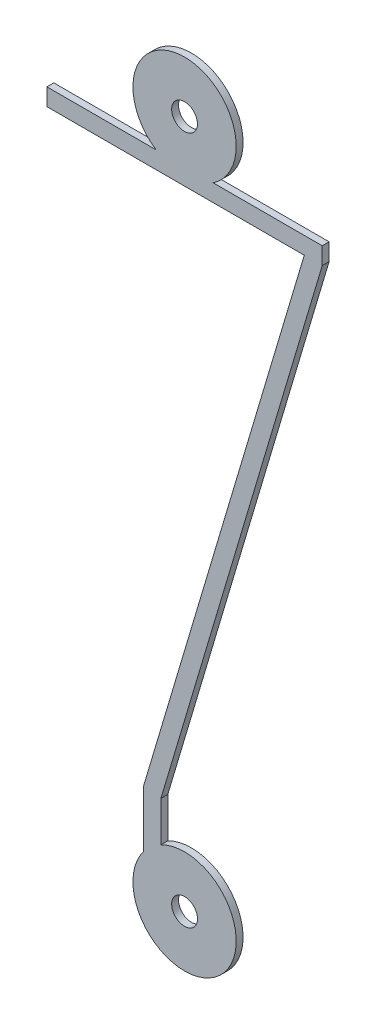
ISO-10303-21;
HEADER;
FILE_DESCRIPTION(('STEP AP214'),'2;1');
FILE_NAME('part.step','',(''),(''),'','','');
FILE_SCHEMA(('AUTOMOTIVE_DESIGN { 1 0 10303 214 1 1 1 1 }'));
ENDSEC;
DATA;
#1=APPLICATION_CONTEXT('core data for automotive mechanical design processes');
#2=APPLICATION_PROTOCOL_DEFINITION('international standard','automotive_design',2000,#1);
#3=PRODUCT_CONTEXT('',#1,'mechanical');
#4=PRODUCT('Part','Part','',(#3));
#5=PRODUCT_RELATED_PRODUCT_CATEGORY('part','',(#4));
#6=PRODUCT_DEFINITION_FORMATION('','',#4);
#7=PRODUCT_DEFINITION_CONTEXT('part definition',#1,'design');
#8=PRODUCT_DEFINITION('design','',#6,#7);
#9=PRODUCT_DEFINITION_SHAPE('','',#8);
#10=(LENGTH_UNIT() NAMED_UNIT(*) SI_UNIT(.MILLI.,.METRE.));
#11=(NAMED_UNIT(*) PLANE_ANGLE_UNIT() SI_UNIT($,.RADIAN.));
#12=(NAMED_UNIT(*) SI_UNIT($,.STERADIAN.) SOLID_ANGLE_UNIT());
#13=UNCERTAINTY_MEASURE_WITH_UNIT(LENGTH_MEASURE(1.E-05),#10,'distance_accuracy_value','');
#14=(GEOMETRIC_REPRESENTATION_CONTEXT(3) GLOBAL_UNCERTAINTY_ASSIGNED_CONTEXT((#13)) GLOBAL_UNIT_ASSIGNED_CONTEXT((#10,
#11,#12)) REPRESENTATION_CONTEXT('',''));
#15=CARTESIAN_POINT('',(0.,0.,0.));
#16=DIRECTION('',(0.,0.,1.));
#17=DIRECTION('',(1.,0.,0.));
#18=AXIS2_PLACEMENT_3D('',#15,#16,#17);
#19=CARTESIAN_POINT('',(0.,10.,0.1));
#20=DIRECTION('',(0.,0.,1.));
#21=DIRECTION('',(1.,0.,0.));
#22=AXIS2_PLACEMENT_3D('',#19,#20,#21);
#23=PLANE('',#22);
#24=CARTESIAN_POINT('',(0.,10.,0.1));
#25=DIRECTION('',(0.,0.,1.));
#26=DIRECTION('',(1.,0.,0.));
#27=AXIS2_PLACEMENT_3D('',#24,#25,#26);
#28=CIRCLE('',#27,0.375);
#29=CARTESIAN_POINT('',(0.375,10.,0.1));
#30=VERTEX_POINT('',#29);
#31=EDGE_CURVE('E153',#30,#30,#28,.T.);
#32=ORIENTED_EDGE('',*,*,#31,.F.);
#33=EDGE_LOOP('',(#32));
#34=FACE_BOUND('',#33,.T.);
#35=CARTESIAN_POINT('',(0.,10.,0.1));
#36=DIRECTION('',(0.,0.,1.));
#37=DIRECTION('',(1.,0.,0.));
#38=AXIS2_PLACEMENT_3D('',#35,#36,#37);
#39=CIRCLE('',#38,1.5);
#40=CARTESIAN_POINT('',(0.829156197588853,8.75,0.1));
#41=VERTEX_POINT('',#40);
#42=CARTESIAN_POINT('',(-0.829156197588853,8.75,0.1));
#43=VERTEX_POINT('',#42);
#44=EDGE_CURVE('E170',#41,#43,#39,.T.);
#45=ORIENTED_EDGE('',*,*,#44,.T.);
#46=DIRECTION('',(-1.,0.,0.));
#47=VECTOR('',#46,1.);
#48=CARTESIAN_POINT('',(-4.,8.75,0.1));
#49=LINE('',#48,#47);
#50=CARTESIAN_POINT('',(-4.,8.75,0.1));
#51=VERTEX_POINT('',#50);
#52=EDGE_CURVE('E103',#43,#51,#49,.T.);
#53=ORIENTED_EDGE('',*,*,#52,.T.);
#54=DIRECTION('',(0.,-1.,0.));
#55=VECTOR('',#54,1.);
#56=CARTESIAN_POINT('',(-4.,8.75,0.1));
#57=LINE('',#56,#55);
#58=CARTESIAN_POINT('',(-4.,8.25,0.1));
#59=VERTEX_POINT('',#58);
#60=EDGE_CURVE('E194',#51,#59,#57,.T.);
#61=ORIENTED_EDGE('',*,*,#60,.T.);
#62=DIRECTION('',(1.,0.,0.));
#63=VECTOR('',#62,1.);
#64=CARTESIAN_POINT('',(-4.,8.25,0.1));
#65=LINE('',#64,#63);
#66=CARTESIAN_POINT('',(3.47832550917606,8.25,0.1));
#67=VERTEX_POINT('',#66);
#68=EDGE_CURVE('E213',#59,#67,#65,.T.);
#69=ORIENTED_EDGE('',*,*,#68,.T.);
#70=DIRECTION('',(-0.285253594774189,-0.958452078441276,0.));
#71=VECTOR('',#70,1.);
#72=CARTESIAN_POINT('',(3.47832550917606,8.25,0.1));
#73=LINE('',#72,#71);
#74=CARTESIAN_POINT('',(-1.18749999999999,-7.42717371083153,0.1));
#75=VERTEX_POINT('',#74);
#76=EDGE_CURVE('E210',#67,#75,#73,.T.);
#77=ORIENTED_EDGE('',*,*,#76,.T.);
#78=DIRECTION('',(0.,-1.,0.));
#79=VECTOR('',#78,1.);
#80=CARTESIAN_POINT('',(-1.18749999999999,-9.08357010633655,0.1));
#81=LINE('',#80,#79);
#82=CARTESIAN_POINT('',(-1.18749999999999,-9.08357010633655,0.1));
#83=VERTEX_POINT('',#82);
#84=EDGE_CURVE('E212',#75,#83,#81,.T.);
#85=ORIENTED_EDGE('',*,*,#84,.T.);
#86=CARTESIAN_POINT('',(0.,-10.,0.1));
#87=DIRECTION('',(0.,0.,1.));
#88=DIRECTION('',(1.,0.,0.));
#89=AXIS2_PLACEMENT_3D('',#86,#87,#88);
#90=CIRCLE('',#89,1.5);
#91=CARTESIAN_POINT('',(-0.687499999999994,-8.66682943701865,0.1));
#92=VERTEX_POINT('',#91);
#93=EDGE_CURVE('E215',#83,#92,#90,.T.);
#94=ORIENTED_EDGE('',*,*,#93,.T.);
#95=DIRECTION('',(0.,1.,0.));
#96=VECTOR('',#95,1.);
#97=CARTESIAN_POINT('',(-0.687499999999994,-8.66682943701865,0.1));
#98=LINE('',#97,#96);
#99=CARTESIAN_POINT('',(-0.687499999999994,-7.5,0.1));
#100=VERTEX_POINT('',#99);
#101=EDGE_CURVE('E131',#92,#100,#98,.T.);
#102=ORIENTED_EDGE('',*,*,#101,.T.);
#103=DIRECTION('',(0.285253594774189,0.958452078441276,0.));
#104=VECTOR('',#103,1.);
#105=CARTESIAN_POINT('',(4.,8.25,0.1));
#106=LINE('',#105,#104);
#107=CARTESIAN_POINT('',(4.,8.25,0.1));
#108=VERTEX_POINT('',#107);
#109=EDGE_CURVE('E125',#100,#108,#106,.T.);
#110=ORIENTED_EDGE('',*,*,#109,.T.);
#111=DIRECTION('',(0.,1.,0.));
#112=VECTOR('',#111,1.);
#113=CARTESIAN_POINT('',(4.,8.75,0.1));
#114=LINE('',#113,#112);
#115=CARTESIAN_POINT('',(4.,8.75,0.1));
#116=VERTEX_POINT('',#115);
#117=EDGE_CURVE('E129',#108,#116,#114,.T.);
#118=ORIENTED_EDGE('',*,*,#117,.T.);
#119=DIRECTION('',(-1.,0.,0.));
#120=VECTOR('',#119,1.);
#121=CARTESIAN_POINT('',(0.829156197588853,8.75,0.1));
#122=LINE('',#121,#120);
#123=EDGE_CURVE('E51',#116,#41,#122,.T.);
#124=ORIENTED_EDGE('',*,*,#123,.T.);
#125=EDGE_LOOP('',(#45,#53,#61,#69,#77,#85,#94,#102,#110,#118,#124));
#126=FACE_BOUND('',#125,.T.);
#127=CARTESIAN_POINT('',(0.,-10.,0.1));
#128=DIRECTION('',(0.,0.,1.));
#129=DIRECTION('',(1.,0.,0.));
#130=AXIS2_PLACEMENT_3D('',#127,#128,#129);
#131=CIRCLE('',#130,0.375);
#132=CARTESIAN_POINT('',(0.375000000000006,-10.,0.1));
#133=VERTEX_POINT('',#132);
#134=EDGE_CURVE('E260',#133,#133,#131,.T.);
#135=ORIENTED_EDGE('',*,*,#134,.F.);
#136=EDGE_LOOP('',(#135));
#137=FACE_BOUND('',#136,.T.);
#138=ADVANCED_FACE('F34',(#34,#126,#137),#23,.T.);
#139=CARTESIAN_POINT('',(0.,10.,-0.1));
#140=DIRECTION('',(0.,0.,1.));
#141=DIRECTION('',(1.,0.,0.));
#142=AXIS2_PLACEMENT_3D('',#139,#140,#141);
#143=PLANE('',#142);
#144=CARTESIAN_POINT('',(0.,10.,-0.1));
#145=DIRECTION('',(0.,0.,1.));
#146=DIRECTION('',(1.,0.,0.));
#147=AXIS2_PLACEMENT_3D('',#144,#145,#146);
#148=CIRCLE('',#147,1.5);
#149=CARTESIAN_POINT('',(0.829156197588853,8.75,-0.1));
#150=VERTEX_POINT('',#149);
#151=CARTESIAN_POINT('',(-0.829156197588853,8.75,-0.1));
#152=VERTEX_POINT('',#151);
#153=EDGE_CURVE('E149',#150,#152,#148,.T.);
#154=ORIENTED_EDGE('',*,*,#153,.F.);
#155=DIRECTION('',(-1.,0.,0.));
#156=VECTOR('',#155,1.);
#157=CARTESIAN_POINT('',(0.829156197588853,8.75,-0.1));
#158=LINE('',#157,#156);
#159=CARTESIAN_POINT('',(4.,8.75,-0.1));
#160=VERTEX_POINT('',#159);
#161=EDGE_CURVE('E95',#160,#150,#158,.T.);
#162=ORIENTED_EDGE('',*,*,#161,.F.);
#163=DIRECTION('',(0.,1.,0.));
#164=VECTOR('',#163,1.);
#165=CARTESIAN_POINT('',(4.,8.75,-0.1));
#166=LINE('',#165,#164);
#167=CARTESIAN_POINT('',(4.,8.25,-0.1));
#168=VERTEX_POINT('',#167);
#169=EDGE_CURVE('E89',#168,#160,#166,.T.);
#170=ORIENTED_EDGE('',*,*,#169,.F.);
#171=DIRECTION('',(0.285253594774189,0.958452078441276,0.));
#172=VECTOR('',#171,1.);
#173=CARTESIAN_POINT('',(4.,8.25,-0.1));
#174=LINE('',#173,#172);
#175=CARTESIAN_POINT('',(-0.687499999999994,-7.5,-0.1));
#176=VERTEX_POINT('',#175);
#177=EDGE_CURVE('E139',#176,#168,#174,.T.);
#178=ORIENTED_EDGE('',*,*,#177,.F.);
#179=DIRECTION('',(0.,1.,0.));
#180=VECTOR('',#179,1.);
#181=CARTESIAN_POINT('',(-0.687499999999994,-8.66682943701865,-0.1));
#182=LINE('',#181,#180);
#183=CARTESIAN_POINT('',(-0.687499999999994,-8.66682943701865,-0.1));
#184=VERTEX_POINT('',#183);
#185=EDGE_CURVE('E165',#184,#176,#182,.T.);
#186=ORIENTED_EDGE('',*,*,#185,.F.);
#187=CARTESIAN_POINT('',(0.,-10.,-0.1));
#188=DIRECTION('',(0.,0.,1.));
#189=DIRECTION('',(1.,0.,0.));
#190=AXIS2_PLACEMENT_3D('',#187,#188,#189);
#191=CIRCLE('',#190,1.5);
#192=CARTESIAN_POINT('',(-1.18749999999999,-9.08357010633655,-0.1));
#193=VERTEX_POINT('',#192);
#194=EDGE_CURVE('E163',#193,#184,#191,.T.);
#195=ORIENTED_EDGE('',*,*,#194,.F.);
#196=DIRECTION('',(0.,-1.,0.));
#197=VECTOR('',#196,1.);
#198=CARTESIAN_POINT('',(-1.18749999999999,-9.08357010633655,-0.1));
#199=LINE('',#198,#197);
#200=CARTESIAN_POINT('',(-1.18749999999999,-7.42717371083153,-0.1));
#201=VERTEX_POINT('',#200);
#202=EDGE_CURVE('E161',#201,#193,#199,.T.);
#203=ORIENTED_EDGE('',*,*,#202,.F.);
#204=DIRECTION('',(-0.285253594774189,-0.958452078441276,0.));
#205=VECTOR('',#204,1.);
#206=CARTESIAN_POINT('',(3.47832550917606,8.25,-0.1));
#207=LINE('',#206,#205);
#208=CARTESIAN_POINT('',(3.47832550917606,8.25,-0.1));
#209=VERTEX_POINT('',#208);
#210=EDGE_CURVE('E159',#209,#201,#207,.T.);
#211=ORIENTED_EDGE('',*,*,#210,.F.);
#212=DIRECTION('',(1.,0.,0.));
#213=VECTOR('',#212,1.);
#214=CARTESIAN_POINT('',(-4.,8.25,-0.1));
#215=LINE('',#214,#213);
#216=CARTESIAN_POINT('',(-4.,8.25,-0.1));
#217=VERTEX_POINT('',#216);
#218=EDGE_CURVE('E157',#217,#209,#215,.T.);
#219=ORIENTED_EDGE('',*,*,#218,.F.);
#220=DIRECTION('',(0.,-1.,0.));
#221=VECTOR('',#220,1.);
#222=CARTESIAN_POINT('',(-4.,8.75,-0.1));
#223=LINE('',#222,#221);
#224=CARTESIAN_POINT('',(-4.,8.75,-0.1));
#225=VERTEX_POINT('',#224);
#226=EDGE_CURVE('E155',#225,#217,#223,.T.);
#227=ORIENTED_EDGE('',*,*,#226,.F.);
#228=DIRECTION('',(-1.,0.,0.));
#229=VECTOR('',#228,1.);
#230=CARTESIAN_POINT('',(-4.,8.75,-0.1));
#231=LINE('',#230,#229);
#232=EDGE_CURVE('E152',#152,#225,#231,.T.);
#233=ORIENTED_EDGE('',*,*,#232,.F.);
#234=EDGE_LOOP('',(#154,#162,#170,#178,#186,#195,#203,#211,#219,#227,#233));
#235=FACE_BOUND('',#234,.T.);
#236=CARTESIAN_POINT('',(0.,10.,-0.1));
#237=DIRECTION('',(0.,0.,1.));
#238=DIRECTION('',(1.,0.,0.));
#239=AXIS2_PLACEMENT_3D('',#236,#237,#238);
#240=CIRCLE('',#239,0.375);
#241=CARTESIAN_POINT('',(0.375,10.,-0.1));
#242=VERTEX_POINT('',#241);
#243=EDGE_CURVE('E266',#242,#242,#240,.T.);
#244=ORIENTED_EDGE('',*,*,#243,.T.);
#245=EDGE_LOOP('',(#244));
#246=FACE_BOUND('',#245,.T.);
#247=CARTESIAN_POINT('',(0.,-10.,-0.1));
#248=DIRECTION('',(0.,0.,1.));
#249=DIRECTION('',(1.,0.,0.));
#250=AXIS2_PLACEMENT_3D('',#247,#248,#249);
#251=CIRCLE('',#250,0.375);
#252=CARTESIAN_POINT('',(0.375000000000006,-10.,-0.1));
#253=VERTEX_POINT('',#252);
#254=EDGE_CURVE('E263',#253,#253,#251,.T.);
#255=ORIENTED_EDGE('',*,*,#254,.T.);
#256=EDGE_LOOP('',(#255));
#257=FACE_BOUND('',#256,.T.);
#258=ADVANCED_FACE('F198',(#235,#246,#257),#143,.F.);
#259=CARTESIAN_POINT('',(0.,10.,0.1));
#260=DIRECTION('',(0.,0.,-1.));
#261=DIRECTION('',(-1.,0.,0.));
#262=AXIS2_PLACEMENT_3D('',#259,#260,#261);
#263=CYLINDRICAL_SURFACE('',#262,1.5);
#264=ORIENTED_EDGE('',*,*,#153,.T.);
#265=DIRECTION('',(0.,0.,-1.));
#266=VECTOR('',#265,1.);
#267=CARTESIAN_POINT('',(-0.829156197588853,8.75,0.1));
#268=LINE('',#267,#266);
#269=EDGE_CURVE('E11',#43,#152,#268,.T.);
#270=ORIENTED_EDGE('',*,*,#269,.F.);
#271=ORIENTED_EDGE('',*,*,#44,.F.);
#272=DIRECTION('',(0.,0.,-1.));
#273=VECTOR('',#272,1.);
#274=CARTESIAN_POINT('',(0.829156197588853,8.75,0.1));
#275=LINE('',#274,#273);
#276=EDGE_CURVE('E145',#41,#150,#275,.T.);
#277=ORIENTED_EDGE('',*,*,#276,.T.);
#278=EDGE_LOOP('',(#264,#270,#271,#277));
#279=FACE_BOUND('',#278,.T.);
#280=ADVANCED_FACE('F36',(#279),#263,.T.);
#281=CARTESIAN_POINT('',(-4.,8.75,0.1));
#282=DIRECTION('',(0.,-1.,0.));
#283=DIRECTION('',(0.,0.,-1.));
#284=AXIS2_PLACEMENT_3D('',#281,#282,#283);
#285=PLANE('',#284);
#286=ORIENTED_EDGE('',*,*,#232,.T.);
#287=DIRECTION('',(0.,0.,-1.));
#288=VECTOR('',#287,1.);
#289=CARTESIAN_POINT('',(-4.,8.75,0.1));
#290=LINE('',#289,#288);
#291=EDGE_CURVE('E43',#51,#225,#290,.T.);
#292=ORIENTED_EDGE('',*,*,#291,.F.);
#293=ORIENTED_EDGE('',*,*,#52,.F.);
#294=ORIENTED_EDGE('',*,*,#269,.T.);
#295=EDGE_LOOP('',(#286,#292,#293,#294));
#296=FACE_BOUND('',#295,.T.);
#297=ADVANCED_FACE('F349',(#296),#285,.F.);
#298=CARTESIAN_POINT('',(-4.,8.75,0.1));
#299=DIRECTION('',(1.,0.,0.));
#300=DIRECTION('',(0.,0.,-1.));
#301=AXIS2_PLACEMENT_3D('',#298,#299,#300);
#302=PLANE('',#301);
#303=ORIENTED_EDGE('',*,*,#226,.T.);
#304=DIRECTION('',(0.,0.,-1.));
#305=VECTOR('',#304,1.);
#306=CARTESIAN_POINT('',(-4.,8.25,0.1));
#307=LINE('',#306,#305);
#308=EDGE_CURVE('E186',#59,#217,#307,.T.);
#309=ORIENTED_EDGE('',*,*,#308,.F.);
#310=ORIENTED_EDGE('',*,*,#60,.F.);
#311=ORIENTED_EDGE('',*,*,#291,.T.);
#312=EDGE_LOOP('',(#303,#309,#310,#311));
#313=FACE_BOUND('',#312,.T.);
#314=ADVANCED_FACE('F192',(#313),#302,.F.);
#315=CARTESIAN_POINT('',(-4.,8.25,0.1));
#316=DIRECTION('',(0.,1.,0.));
#317=DIRECTION('',(0.,0.,1.));
#318=AXIS2_PLACEMENT_3D('',#315,#316,#317);
#319=PLANE('',#318);
#320=ORIENTED_EDGE('',*,*,#218,.T.);
#321=DIRECTION('',(0.,0.,-1.));
#322=VECTOR('',#321,1.);
#323=CARTESIAN_POINT('',(3.47832550917606,8.25,0.1));
#324=LINE('',#323,#322);
#325=EDGE_CURVE('E183',#67,#209,#324,.T.);
#326=ORIENTED_EDGE('',*,*,#325,.F.);
#327=ORIENTED_EDGE('',*,*,#68,.F.);
#328=ORIENTED_EDGE('',*,*,#308,.T.);
#329=EDGE_LOOP('',(#320,#326,#327,#328));
#330=FACE_BOUND('',#329,.T.);
#331=ADVANCED_FACE('F204',(#330),#319,.F.);
#332=CARTESIAN_POINT('',(3.47832550917606,8.25,0.1));
#333=DIRECTION('',(0.958452078441276,-0.285253594774189,0.));
#334=DIRECTION('',(0.285253594774189,0.958452078441277,0.));
#335=AXIS2_PLACEMENT_3D('',#332,#333,#334);
#336=PLANE('',#335);
#337=ORIENTED_EDGE('',*,*,#210,.T.);
#338=DIRECTION('',(0.,0.,-1.));
#339=VECTOR('',#338,1.);
#340=CARTESIAN_POINT('',(-1.18749999999999,-7.42717371083153,0.1));
#341=LINE('',#340,#339);
#342=EDGE_CURVE('E180',#75,#201,#341,.T.);
#343=ORIENTED_EDGE('',*,*,#342,.F.);
#344=ORIENTED_EDGE('',*,*,#76,.F.);
#345=ORIENTED_EDGE('',*,*,#325,.T.);
#346=EDGE_LOOP('',(#337,#343,#344,#345));
#347=FACE_BOUND('',#346,.T.);
#348=ADVANCED_FACE('F208',(#347),#336,.F.);
#349=CARTESIAN_POINT('',(-1.18749999999999,-9.08357010633655,0.1));
#350=DIRECTION('',(1.,0.,0.));
#351=DIRECTION('',(0.,1.,0.));
#352=AXIS2_PLACEMENT_3D('',#349,#350,#351);
#353=PLANE('',#352);
#354=ORIENTED_EDGE('',*,*,#202,.T.);
#355=DIRECTION('',(0.,0.,-1.));
#356=VECTOR('',#355,1.);
#357=CARTESIAN_POINT('',(-1.18749999999999,-9.08357010633655,0.1));
#358=LINE('',#357,#356);
#359=EDGE_CURVE('E177',#83,#193,#358,.T.);
#360=ORIENTED_EDGE('',*,*,#359,.F.);
#361=ORIENTED_EDGE('',*,*,#84,.F.);
#362=ORIENTED_EDGE('',*,*,#342,.T.);
#363=EDGE_LOOP('',(#354,#360,#361,#362));
#364=FACE_BOUND('',#363,.T.);
#365=ADVANCED_FACE('F315',(#364),#353,.F.);
#366=CARTESIAN_POINT('',(0.,-10.,0.1));
#367=DIRECTION('',(0.,0.,-1.));
#368=DIRECTION('',(-1.,0.,0.));
#369=AXIS2_PLACEMENT_3D('',#366,#367,#368);
#370=CYLINDRICAL_SURFACE('',#369,1.5);
#371=ORIENTED_EDGE('',*,*,#194,.T.);
#372=DIRECTION('',(0.,0.,-1.));
#373=VECTOR('',#372,1.);
#374=CARTESIAN_POINT('',(-0.687499999999994,-8.66682943701865,0.1));
#375=LINE('',#374,#373);
#376=EDGE_CURVE('E174',#92,#184,#375,.T.);
#377=ORIENTED_EDGE('',*,*,#376,.F.);
#378=ORIENTED_EDGE('',*,*,#93,.F.);
#379=ORIENTED_EDGE('',*,*,#359,.T.);
#380=EDGE_LOOP('',(#371,#377,#378,#379));
#381=FACE_BOUND('',#380,.T.);
#382=ADVANCED_FACE('F224',(#381),#370,.T.);
#383=CARTESIAN_POINT('',(-0.687499999999994,-8.66682943701865,0.1));
#384=DIRECTION('',(-1.,0.,0.));
#385=DIRECTION('',(0.,0.,1.));
#386=AXIS2_PLACEMENT_3D('',#383,#384,#385);
#387=PLANE('',#386);
#388=ORIENTED_EDGE('',*,*,#185,.T.);
#389=DIRECTION('',(0.,0.,-1.));
#390=VECTOR('',#389,1.);
#391=CARTESIAN_POINT('',(-0.687499999999994,-7.5,0.1));
#392=LINE('',#391,#390);
#393=EDGE_CURVE('E140',#100,#176,#392,.T.);
#394=ORIENTED_EDGE('',*,*,#393,.F.);
#395=ORIENTED_EDGE('',*,*,#101,.F.);
#396=ORIENTED_EDGE('',*,*,#376,.T.);
#397=EDGE_LOOP('',(#388,#394,#395,#396));
#398=FACE_BOUND('',#397,.T.);
#399=ADVANCED_FACE('F228',(#398),#387,.F.);
#400=CARTESIAN_POINT('',(4.,8.25,0.1));
#401=DIRECTION('',(-0.958452078441277,0.285253594774189,0.));
#402=DIRECTION('',(-0.285253594774189,-0.958452078441277,0.));
#403=AXIS2_PLACEMENT_3D('',#400,#401,#402);
#404=PLANE('',#403);
#405=ORIENTED_EDGE('',*,*,#177,.T.);
#406=DIRECTION('',(0.,0.,-1.));
#407=VECTOR('',#406,1.);
#408=CARTESIAN_POINT('',(4.,8.25,0.1));
#409=LINE('',#408,#407);
#410=EDGE_CURVE('E136',#108,#168,#409,.T.);
#411=ORIENTED_EDGE('',*,*,#410,.F.);
#412=ORIENTED_EDGE('',*,*,#109,.F.);
#413=ORIENTED_EDGE('',*,*,#393,.T.);
#414=EDGE_LOOP('',(#405,#411,#412,#413));
#415=FACE_BOUND('',#414,.T.);
#416=ADVANCED_FACE('F137',(#415),#404,.F.);
#417=CARTESIAN_POINT('',(4.,8.75,0.1));
#418=DIRECTION('',(-1.,0.,0.));
#419=DIRECTION('',(0.,0.,1.));
#420=AXIS2_PLACEMENT_3D('',#417,#418,#419);
#421=PLANE('',#420);
#422=ORIENTED_EDGE('',*,*,#169,.T.);
#423=DIRECTION('',(0.,0.,-1.));
#424=VECTOR('',#423,1.);
#425=CARTESIAN_POINT('',(4.,8.75,0.1));
#426=LINE('',#425,#424);
#427=EDGE_CURVE('E141',#116,#160,#426,.T.);
#428=ORIENTED_EDGE('',*,*,#427,.F.);
#429=ORIENTED_EDGE('',*,*,#117,.F.);
#430=ORIENTED_EDGE('',*,*,#410,.T.);
#431=EDGE_LOOP('',(#422,#428,#429,#430));
#432=FACE_BOUND('',#431,.T.);
#433=ADVANCED_FACE('F143',(#432),#421,.F.);
#434=CARTESIAN_POINT('',(0.829156197588853,8.75,0.1));
#435=DIRECTION('',(0.,-1.,0.));
#436=DIRECTION('',(1.,0.,0.));
#437=AXIS2_PLACEMENT_3D('',#434,#435,#436);
#438=PLANE('',#437);
#439=ORIENTED_EDGE('',*,*,#161,.T.);
#440=ORIENTED_EDGE('',*,*,#276,.F.);
#441=ORIENTED_EDGE('',*,*,#123,.F.);
#442=ORIENTED_EDGE('',*,*,#427,.T.);
#443=EDGE_LOOP('',(#439,#440,#441,#442));
#444=FACE_BOUND('',#443,.T.);
#445=ADVANCED_FACE('F232',(#444),#438,.F.);
#446=CARTESIAN_POINT('',(0.,10.,0.1));
#447=DIRECTION('',(0.,0.,-1.));
#448=DIRECTION('',(-1.,0.,0.));
#449=AXIS2_PLACEMENT_3D('',#446,#447,#448);
#450=CYLINDRICAL_SURFACE('',#449,0.375);
#451=ORIENTED_EDGE('',*,*,#31,.T.);
#452=EDGE_LOOP('',(#451));
#453=FACE_BOUND('',#452,.T.);
#454=ORIENTED_EDGE('',*,*,#243,.F.);
#455=EDGE_LOOP('',(#454));
#456=FACE_BOUND('',#455,.T.);
#457=ADVANCED_FACE('F234',(#453,#456),#450,.F.);
#458=CARTESIAN_POINT('',(0.,-10.,0.1));
#459=DIRECTION('',(0.,0.,-1.));
#460=DIRECTION('',(-1.,0.,0.));
#461=AXIS2_PLACEMENT_3D('',#458,#459,#460);
#462=CYLINDRICAL_SURFACE('',#461,0.375);
#463=ORIENTED_EDGE('',*,*,#134,.T.);
#464=EDGE_LOOP('',(#463));
#465=FACE_BOUND('',#464,.T.);
#466=ORIENTED_EDGE('',*,*,#254,.F.);
#467=EDGE_LOOP('',(#466));
#468=FACE_BOUND('',#467,.T.);
#469=ADVANCED_FACE('F240',(#465,#468),#462,.F.);
#470=CLOSED_SHELL('',(#138,#258,#280,#297,#314,#331,#348,#365,#382,#399,#416,#433,#445,#457,#469));
#471=MANIFOLD_SOLID_BREP('B2',#470);
#472=ADVANCED_BREP_SHAPE_REPRESENTATION('',(#18,#471),#14);
#473=SHAPE_DEFINITION_REPRESENTATION(#9,#472);
ENDSEC;
END-ISO-10303-21;
